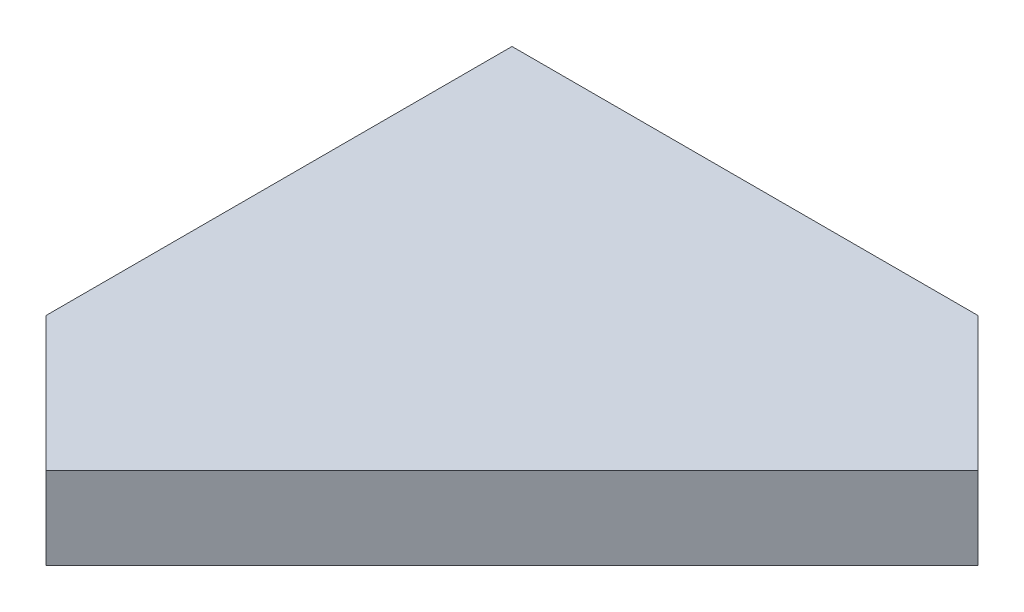
ISO-10303-21;
HEADER;
FILE_DESCRIPTION(('STEP AP214'),'2;1');
FILE_NAME('part.step','',(''),(''),'','','');
FILE_SCHEMA(('AUTOMOTIVE_DESIGN { 1 0 10303 214 1 1 1 1 }'));
ENDSEC;
DATA;
#1=APPLICATION_CONTEXT('core data for automotive mechanical design processes');
#2=APPLICATION_PROTOCOL_DEFINITION('international standard','automotive_design',2000,#1);
#3=PRODUCT_CONTEXT('',#1,'mechanical');
#4=PRODUCT('Part','Part','',(#3));
#5=PRODUCT_RELATED_PRODUCT_CATEGORY('part','',(#4));
#6=PRODUCT_DEFINITION_FORMATION('','',#4);
#7=PRODUCT_DEFINITION_CONTEXT('part definition',#1,'design');
#8=PRODUCT_DEFINITION('design','',#6,#7);
#9=PRODUCT_DEFINITION_SHAPE('','',#8);
#10=(LENGTH_UNIT() NAMED_UNIT(*) SI_UNIT(.MILLI.,.METRE.));
#11=(NAMED_UNIT(*) PLANE_ANGLE_UNIT() SI_UNIT($,.RADIAN.));
#12=(NAMED_UNIT(*) SI_UNIT($,.STERADIAN.) SOLID_ANGLE_UNIT());
#13=UNCERTAINTY_MEASURE_WITH_UNIT(LENGTH_MEASURE(1.E-05),#10,'distance_accuracy_value','');
#14=(GEOMETRIC_REPRESENTATION_CONTEXT(3) GLOBAL_UNCERTAINTY_ASSIGNED_CONTEXT((#13)) GLOBAL_UNIT_ASSIGNED_CONTEXT((#10,
#11,#12)) REPRESENTATION_CONTEXT('',''));
#15=CARTESIAN_POINT('',(0.,0.,0.));
#16=DIRECTION('',(0.,0.,1.));
#17=DIRECTION('',(1.,0.,0.));
#18=AXIS2_PLACEMENT_3D('',#15,#16,#17);
#19=CARTESIAN_POINT('',(0.,0.2,0.));
#20=DIRECTION('',(0.,1.,0.));
#21=DIRECTION('',(-1.,0.,0.));
#22=AXIS2_PLACEMENT_3D('',#19,#20,#21);
#23=PLANE('',#22);
#24=DIRECTION('',(-0.707106781186547,0.,0.707106781186548));
#25=VECTOR('',#24,1.);
#26=CARTESIAN_POINT('',(-2.79289321881347,0.200000000000014,-3.9242640687119));
#27=LINE('',#26,#25);
#28=CARTESIAN_POINT('',(-2.79289321881347,0.200000000000013,-3.9242640687119));
#29=VERTEX_POINT('',#28);
#30=CARTESIAN_POINT('',(-3.92426406871195,0.200000000000009,-2.79289321881342));
#31=VERTEX_POINT('',#30);
#32=EDGE_CURVE('E11',#29,#31,#27,.T.);
#33=ORIENTED_EDGE('',*,*,#32,.F.);
#34=DIRECTION('',(0.707106781186549,0.,0.707106781186547));
#35=VECTOR('',#34,1.);
#36=CARTESIAN_POINT('',(-3.11862915010156,0.200000000000014,-4.24999999999999));
#37=LINE('',#36,#35);
#38=CARTESIAN_POINT('',(-3.11862915010156,0.200000000000014,-4.24999999999999));
#39=VERTEX_POINT('',#38);
#40=EDGE_CURVE('E24',#39,#29,#37,.T.);
#41=ORIENTED_EDGE('',*,*,#40,.F.);
#42=DIRECTION('',(1.,0.,0.));
#43=VECTOR('',#42,1.);
#44=CARTESIAN_POINT('',(-4.24999999999998,0.200000000000014,-4.24999999999999));
#45=LINE('',#44,#43);
#46=CARTESIAN_POINT('',(-4.24999999999998,0.200000000000015,-4.24999999999999));
#47=VERTEX_POINT('',#46);
#48=EDGE_CURVE('E81',#47,#39,#45,.T.);
#49=ORIENTED_EDGE('',*,*,#48,.F.);
#50=DIRECTION('',(0.,0.,-1.));
#51=VECTOR('',#50,1.);
#52=CARTESIAN_POINT('',(-4.24999999999998,0.200000000000011,-3.11862915010145));
#53=LINE('',#52,#51);
#54=CARTESIAN_POINT('',(-4.24999999999998,0.20000000000001,-3.11862915010145));
#55=VERTEX_POINT('',#54);
#56=EDGE_CURVE('E99',#55,#47,#53,.T.);
#57=ORIENTED_EDGE('',*,*,#56,.F.);
#58=DIRECTION('',(-0.707106781186547,0.,-0.707106781186549));
#59=VECTOR('',#58,1.);
#60=CARTESIAN_POINT('',(-3.92426406871195,0.200000000000009,-2.79289321881342));
#61=LINE('',#60,#59);
#62=EDGE_CURVE('E96',#31,#55,#61,.T.);
#63=ORIENTED_EDGE('',*,*,#62,.F.);
#64=EDGE_LOOP('',(#33,#41,#49,#57,#63));
#65=FACE_BOUND('',#64,.T.);
#66=ADVANCED_FACE('F17',(#65),#23,.T.);
#67=CARTESIAN_POINT('',(0.,0.,0.));
#68=DIRECTION('',(0.,-1.,0.));
#69=DIRECTION('',(0.,0.,-1.));
#70=AXIS2_PLACEMENT_3D('',#67,#68,#69);
#71=PLANE('',#70);
#72=DIRECTION('',(-0.707106781186547,0.,0.707106781186548));
#73=VECTOR('',#72,1.);
#74=CARTESIAN_POINT('',(-2.79289321881347,0.,-3.9242640687119));
#75=LINE('',#74,#73);
#76=CARTESIAN_POINT('',(-2.79289321881347,0.,-3.9242640687119));
#77=VERTEX_POINT('',#76);
#78=CARTESIAN_POINT('',(-3.92426406871195,0.,-2.79289321881342));
#79=VERTEX_POINT('',#78);
#80=EDGE_CURVE('E94',#77,#79,#75,.T.);
#81=ORIENTED_EDGE('',*,*,#80,.T.);
#82=DIRECTION('',(-0.707106781186547,0.,-0.707106781186549));
#83=VECTOR('',#82,1.);
#84=CARTESIAN_POINT('',(-3.92426406871195,0.,-2.79289321881342));
#85=LINE('',#84,#83);
#86=CARTESIAN_POINT('',(-4.24999999999998,0.,-3.11862915010145));
#87=VERTEX_POINT('',#86);
#88=EDGE_CURVE('E92',#79,#87,#85,.T.);
#89=ORIENTED_EDGE('',*,*,#88,.T.);
#90=DIRECTION('',(0.,0.,-1.));
#91=VECTOR('',#90,1.);
#92=CARTESIAN_POINT('',(-4.24999999999998,0.,-3.11862915010145));
#93=LINE('',#92,#91);
#94=CARTESIAN_POINT('',(-4.24999999999998,0.,-4.24999999999999));
#95=VERTEX_POINT('',#94);
#96=EDGE_CURVE('E66',#87,#95,#93,.T.);
#97=ORIENTED_EDGE('',*,*,#96,.T.);
#98=DIRECTION('',(1.,0.,0.));
#99=VECTOR('',#98,1.);
#100=CARTESIAN_POINT('',(-4.24999999999998,0.,-4.24999999999999));
#101=LINE('',#100,#99);
#102=CARTESIAN_POINT('',(-3.11862915010156,0.,-4.24999999999999));
#103=VERTEX_POINT('',#102);
#104=EDGE_CURVE('E60',#95,#103,#101,.T.);
#105=ORIENTED_EDGE('',*,*,#104,.T.);
#106=DIRECTION('',(0.707106781186549,0.,0.707106781186547));
#107=VECTOR('',#106,1.);
#108=CARTESIAN_POINT('',(-3.11862915010156,0.,-4.24999999999999));
#109=LINE('',#108,#107);
#110=EDGE_CURVE('E63',#103,#77,#109,.T.);
#111=ORIENTED_EDGE('',*,*,#110,.T.);
#112=EDGE_LOOP('',(#81,#89,#97,#105,#111));
#113=FACE_BOUND('',#112,.T.);
#114=ADVANCED_FACE('F62',(#113),#71,.T.);
#115=CARTESIAN_POINT('',(-3.92426406871195,4.22492235949963,-2.79289321881341));
#116=DIRECTION('',(-0.707106781186549,0.,0.707106781186547));
#117=DIRECTION('',(0.707106781186547,0.,0.707106781186549));
#118=AXIS2_PLACEMENT_3D('',#115,#116,#117);
#119=PLANE('',#118);
#120=DIRECTION('',(0.,-1.,0.));
#121=VECTOR('',#120,1.);
#122=CARTESIAN_POINT('',(-3.92426406871195,4.22492235949963,-2.79289321881341));
#123=LINE('',#122,#121);
#124=EDGE_CURVE('E77',#31,#79,#123,.T.);
#125=ORIENTED_EDGE('',*,*,#124,.F.);
#126=ORIENTED_EDGE('',*,*,#62,.T.);
#127=DIRECTION('',(0.,-1.,0.));
#128=VECTOR('',#127,1.);
#129=CARTESIAN_POINT('',(-4.24999999999998,4.22492235949963,-3.11862915010144));
#130=LINE('',#129,#128);
#131=EDGE_CURVE('E84',#55,#87,#130,.T.);
#132=ORIENTED_EDGE('',*,*,#131,.T.);
#133=ORIENTED_EDGE('',*,*,#88,.F.);
#134=EDGE_LOOP('',(#125,#126,#132,#133));
#135=FACE_BOUND('',#134,.T.);
#136=ADVANCED_FACE('F106',(#135),#119,.T.);
#137=CARTESIAN_POINT('',(-4.24999999999998,4.22492235949963,-3.11862915010144));
#138=DIRECTION('',(-1.,0.,0.));
#139=DIRECTION('',(0.,-1.,0.));
#140=AXIS2_PLACEMENT_3D('',#137,#138,#139);
#141=PLANE('',#140);
#142=ORIENTED_EDGE('',*,*,#131,.F.);
#143=ORIENTED_EDGE('',*,*,#56,.T.);
#144=DIRECTION('',(0.,-1.,0.));
#145=VECTOR('',#144,1.);
#146=CARTESIAN_POINT('',(-4.24999999999998,4.22492235949964,-4.24999999999997));
#147=LINE('',#146,#145);
#148=EDGE_CURVE('E82',#47,#95,#147,.T.);
#149=ORIENTED_EDGE('',*,*,#148,.T.);
#150=ORIENTED_EDGE('',*,*,#96,.F.);
#151=EDGE_LOOP('',(#142,#143,#149,#150));
#152=FACE_BOUND('',#151,.T.);
#153=ADVANCED_FACE('F109',(#152),#141,.T.);
#154=CARTESIAN_POINT('',(-4.24999999999998,4.22492235949964,-4.24999999999997));
#155=DIRECTION('',(0.,0.,-1.));
#156=DIRECTION('',(0.,1.,0.));
#157=AXIS2_PLACEMENT_3D('',#154,#155,#156);
#158=PLANE('',#157);
#159=ORIENTED_EDGE('',*,*,#148,.F.);
#160=ORIENTED_EDGE('',*,*,#48,.T.);
#161=DIRECTION('',(0.,-1.,0.));
#162=VECTOR('',#161,1.);
#163=CARTESIAN_POINT('',(-3.11862915010156,4.22492235949964,-4.24999999999997));
#164=LINE('',#163,#162);
#165=EDGE_CURVE('E75',#39,#103,#164,.T.);
#166=ORIENTED_EDGE('',*,*,#165,.T.);
#167=ORIENTED_EDGE('',*,*,#104,.F.);
#168=EDGE_LOOP('',(#159,#160,#166,#167));
#169=FACE_BOUND('',#168,.T.);
#170=ADVANCED_FACE('F80',(#169),#158,.T.);
#171=CARTESIAN_POINT('',(-3.11862915010156,4.22492235949964,-4.24999999999997));
#172=DIRECTION('',(0.707106781186547,0.,-0.707106781186549));
#173=DIRECTION('',(-0.707106781186549,0.,-0.707106781186547));
#174=AXIS2_PLACEMENT_3D('',#171,#172,#173);
#175=PLANE('',#174);
#176=ORIENTED_EDGE('',*,*,#165,.F.);
#177=ORIENTED_EDGE('',*,*,#40,.T.);
#178=DIRECTION('',(0.,-1.,0.));
#179=VECTOR('',#178,1.);
#180=CARTESIAN_POINT('',(-2.79289321881347,4.22492235949964,-3.92426406871189));
#181=LINE('',#180,#179);
#182=EDGE_CURVE('E76',#29,#77,#181,.T.);
#183=ORIENTED_EDGE('',*,*,#182,.T.);
#184=ORIENTED_EDGE('',*,*,#110,.F.);
#185=EDGE_LOOP('',(#176,#177,#183,#184));
#186=FACE_BOUND('',#185,.T.);
#187=ADVANCED_FACE('F74',(#186),#175,.T.);
#188=CARTESIAN_POINT('',(-2.79289321881347,4.22492235949964,-3.92426406871189));
#189=DIRECTION('',(0.707106781186548,0.,0.707106781186547));
#190=DIRECTION('',(0.707106781186547,0.,-0.707106781186548));
#191=AXIS2_PLACEMENT_3D('',#188,#189,#190);
#192=PLANE('',#191);
#193=ORIENTED_EDGE('',*,*,#182,.F.);
#194=ORIENTED_EDGE('',*,*,#32,.T.);
#195=ORIENTED_EDGE('',*,*,#124,.T.);
#196=ORIENTED_EDGE('',*,*,#80,.F.);
#197=EDGE_LOOP('',(#193,#194,#195,#196));
#198=FACE_BOUND('',#197,.T.);
#199=ADVANCED_FACE('F102',(#198),#192,.T.);
#200=CLOSED_SHELL('',(#66,#114,#136,#153,#170,#187,#199));
#201=MANIFOLD_SOLID_BREP('B1',#200);
#202=ADVANCED_BREP_SHAPE_REPRESENTATION('',(#18,#201),#14);
#203=SHAPE_DEFINITION_REPRESENTATION(#9,#202);
ENDSEC;
END-ISO-10303-21;
